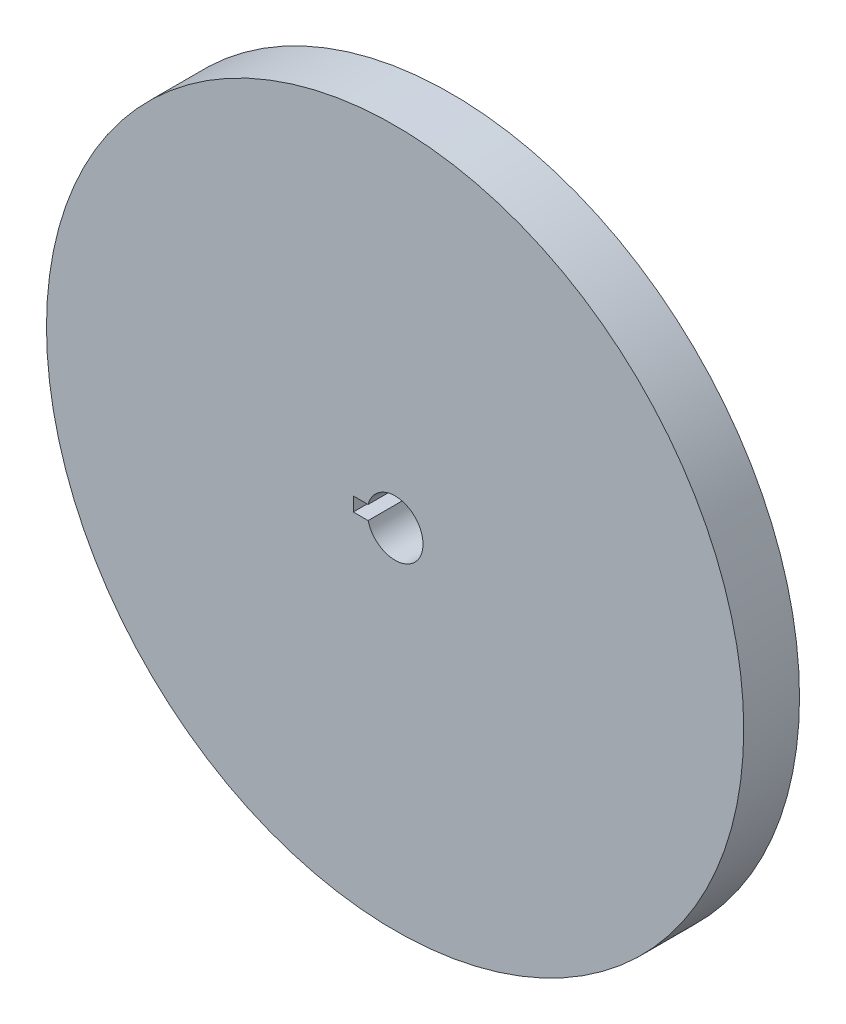
ISO-10303-21;
HEADER;
FILE_DESCRIPTION(('STEP AP214'),'2;1');
FILE_NAME('part.step','',(''),(''),'','','');
FILE_SCHEMA(('AUTOMOTIVE_DESIGN { 1 0 10303 214 1 1 1 1 }'));
ENDSEC;
DATA;
#1=APPLICATION_CONTEXT('core data for automotive mechanical design processes');
#2=APPLICATION_PROTOCOL_DEFINITION('international standard','automotive_design',2000,#1);
#3=PRODUCT_CONTEXT('',#1,'mechanical');
#4=PRODUCT('Part','Part','',(#3));
#5=PRODUCT_RELATED_PRODUCT_CATEGORY('part','',(#4));
#6=PRODUCT_DEFINITION_FORMATION('','',#4);
#7=PRODUCT_DEFINITION_CONTEXT('part definition',#1,'design');
#8=PRODUCT_DEFINITION('design','',#6,#7);
#9=PRODUCT_DEFINITION_SHAPE('','',#8);
#10=(LENGTH_UNIT() NAMED_UNIT(*) SI_UNIT(.MILLI.,.METRE.));
#11=(NAMED_UNIT(*) PLANE_ANGLE_UNIT() SI_UNIT($,.RADIAN.));
#12=(NAMED_UNIT(*) SI_UNIT($,.STERADIAN.) SOLID_ANGLE_UNIT());
#13=UNCERTAINTY_MEASURE_WITH_UNIT(LENGTH_MEASURE(1.E-05),#10,'distance_accuracy_value','');
#14=(GEOMETRIC_REPRESENTATION_CONTEXT(3) GLOBAL_UNCERTAINTY_ASSIGNED_CONTEXT((#13)) GLOBAL_UNIT_ASSIGNED_CONTEXT((#10,
#11,#12)) REPRESENTATION_CONTEXT('',''));
#15=CARTESIAN_POINT('',(0.,0.,0.));
#16=DIRECTION('',(0.,0.,1.));
#17=DIRECTION('',(1.,0.,0.));
#18=AXIS2_PLACEMENT_3D('',#15,#16,#17);
#19=CARTESIAN_POINT('',(0.,0.,20.));
#20=DIRECTION('',(0.,0.,-1.));
#21=DIRECTION('',(-1.,0.,0.));
#22=AXIS2_PLACEMENT_3D('',#19,#20,#21);
#23=CYLINDRICAL_SURFACE('',#22,125.);
#24=CARTESIAN_POINT('',(0.,0.,20.));
#25=DIRECTION('',(0.,0.,1.));
#26=DIRECTION('',(1.,0.,0.));
#27=AXIS2_PLACEMENT_3D('',#24,#25,#26);
#28=CIRCLE('',#27,125.);
#29=CARTESIAN_POINT('',(125.,0.,20.));
#30=VERTEX_POINT('',#29);
#31=EDGE_CURVE('E11',#30,#30,#28,.T.);
#32=ORIENTED_EDGE('',*,*,#31,.F.);
#33=EDGE_LOOP('',(#32));
#34=FACE_BOUND('',#33,.T.);
#35=CARTESIAN_POINT('',(0.,0.,0.));
#36=DIRECTION('',(0.,0.,1.));
#37=DIRECTION('',(1.,0.,0.));
#38=AXIS2_PLACEMENT_3D('',#35,#36,#37);
#39=CIRCLE('',#38,125.);
#40=CARTESIAN_POINT('',(125.,0.,0.));
#41=VERTEX_POINT('',#40);
#42=EDGE_CURVE('E36',#41,#41,#39,.T.);
#43=ORIENTED_EDGE('',*,*,#42,.T.);
#44=EDGE_LOOP('',(#43));
#45=FACE_BOUND('',#44,.T.);
#46=ADVANCED_FACE('F33',(#34,#45),#23,.T.);
#47=CARTESIAN_POINT('',(0.,0.,20.));
#48=DIRECTION('',(0.,0.,1.));
#49=DIRECTION('',(1.,0.,0.));
#50=AXIS2_PLACEMENT_3D('',#47,#48,#49);
#51=PLANE('',#50);
#52=CARTESIAN_POINT('',(0.,0.,20.));
#53=DIRECTION('',(0.,0.,1.));
#54=DIRECTION('',(1.,0.,0.));
#55=AXIS2_PLACEMENT_3D('',#52,#53,#54);
#56=CIRCLE('',#55,10.);
#57=CARTESIAN_POINT('',(-9.68245836551854,-2.5,20.));
#58=VERTEX_POINT('',#57);
#59=CARTESIAN_POINT('',(-9.68245836551854,2.5,20.));
#60=VERTEX_POINT('',#59);
#61=EDGE_CURVE('E47',#58,#60,#56,.T.);
#62=ORIENTED_EDGE('',*,*,#61,.F.);
#63=DIRECTION('',(1.,0.,0.));
#64=VECTOR('',#63,1.);
#65=CARTESIAN_POINT('',(-9.68245836551854,-2.5,20.));
#66=LINE('',#65,#64);
#67=CARTESIAN_POINT('',(-15.,-2.5,20.));
#68=VERTEX_POINT('',#67);
#69=EDGE_CURVE('E91',#68,#58,#66,.T.);
#70=ORIENTED_EDGE('',*,*,#69,.F.);
#71=DIRECTION('',(0.,-1.,0.));
#72=VECTOR('',#71,1.);
#73=CARTESIAN_POINT('',(-15.,2.5,20.));
#74=LINE('',#73,#72);
#75=CARTESIAN_POINT('',(-15.,2.5,20.));
#76=VERTEX_POINT('',#75);
#77=EDGE_CURVE('E94',#76,#68,#74,.T.);
#78=ORIENTED_EDGE('',*,*,#77,.F.);
#79=DIRECTION('',(-1.,0.,0.));
#80=VECTOR('',#79,1.);
#81=CARTESIAN_POINT('',(-9.68245836551854,2.5,20.));
#82=LINE('',#81,#80);
#83=EDGE_CURVE('E100',#60,#76,#82,.T.);
#84=ORIENTED_EDGE('',*,*,#83,.F.);
#85=EDGE_LOOP('',(#62,#70,#78,#84));
#86=FACE_BOUND('',#85,.T.);
#87=ORIENTED_EDGE('',*,*,#31,.T.);
#88=EDGE_LOOP('',(#87));
#89=FACE_BOUND('',#88,.T.);
#90=ADVANCED_FACE('F112',(#86,#89),#51,.T.);
#91=CARTESIAN_POINT('',(0.,0.,0.));
#92=DIRECTION('',(0.,0.,1.));
#93=DIRECTION('',(1.,0.,0.));
#94=AXIS2_PLACEMENT_3D('',#91,#92,#93);
#95=PLANE('',#94);
#96=DIRECTION('',(1.,0.,0.));
#97=VECTOR('',#96,1.);
#98=CARTESIAN_POINT('',(-9.68245836551854,-2.5,0.));
#99=LINE('',#98,#97);
#100=CARTESIAN_POINT('',(-15.,-2.5,0.));
#101=VERTEX_POINT('',#100);
#102=CARTESIAN_POINT('',(-9.68245836551854,-2.5,0.));
#103=VERTEX_POINT('',#102);
#104=EDGE_CURVE('E81',#101,#103,#99,.T.);
#105=ORIENTED_EDGE('',*,*,#104,.T.);
#106=CARTESIAN_POINT('',(0.,0.,0.));
#107=DIRECTION('',(0.,0.,1.));
#108=DIRECTION('',(1.,0.,0.));
#109=AXIS2_PLACEMENT_3D('',#106,#107,#108);
#110=CIRCLE('',#109,10.);
#111=CARTESIAN_POINT('',(-9.68245836551854,2.5,0.));
#112=VERTEX_POINT('',#111);
#113=EDGE_CURVE('E75',#103,#112,#110,.T.);
#114=ORIENTED_EDGE('',*,*,#113,.T.);
#115=DIRECTION('',(-1.,0.,0.));
#116=VECTOR('',#115,1.);
#117=CARTESIAN_POINT('',(-9.68245836551854,2.5,0.));
#118=LINE('',#117,#116);
#119=CARTESIAN_POINT('',(-15.,2.5,0.));
#120=VERTEX_POINT('',#119);
#121=EDGE_CURVE('E84',#112,#120,#118,.T.);
#122=ORIENTED_EDGE('',*,*,#121,.T.);
#123=DIRECTION('',(0.,-1.,0.));
#124=VECTOR('',#123,1.);
#125=CARTESIAN_POINT('',(-15.,2.5,0.));
#126=LINE('',#125,#124);
#127=EDGE_CURVE('E55',#120,#101,#126,.T.);
#128=ORIENTED_EDGE('',*,*,#127,.T.);
#129=EDGE_LOOP('',(#105,#114,#122,#128));
#130=FACE_BOUND('',#129,.T.);
#131=ORIENTED_EDGE('',*,*,#42,.F.);
#132=EDGE_LOOP('',(#131));
#133=FACE_BOUND('',#132,.T.);
#134=ADVANCED_FACE('F88',(#130,#133),#95,.F.);
#135=CARTESIAN_POINT('',(0.,0.,0.));
#136=DIRECTION('',(0.,0.,1.));
#137=DIRECTION('',(1.,0.,0.));
#138=AXIS2_PLACEMENT_3D('',#135,#136,#137);
#139=CYLINDRICAL_SURFACE('',#138,10.);
#140=ORIENTED_EDGE('',*,*,#61,.T.);
#141=DIRECTION('',(0.,0.,1.));
#142=VECTOR('',#141,1.);
#143=CARTESIAN_POINT('',(-9.68245836551854,2.5,0.));
#144=LINE('',#143,#142);
#145=EDGE_CURVE('E71',#112,#60,#144,.T.);
#146=ORIENTED_EDGE('',*,*,#145,.F.);
#147=ORIENTED_EDGE('',*,*,#113,.F.);
#148=DIRECTION('',(0.,0.,1.));
#149=VECTOR('',#148,1.);
#150=CARTESIAN_POINT('',(-9.68245836551854,-2.5,0.));
#151=LINE('',#150,#149);
#152=EDGE_CURVE('E104',#103,#58,#151,.T.);
#153=ORIENTED_EDGE('',*,*,#152,.T.);
#154=EDGE_LOOP('',(#140,#146,#147,#153));
#155=FACE_BOUND('',#154,.T.);
#156=ADVANCED_FACE('F73',(#155),#139,.F.);
#157=CARTESIAN_POINT('',(-9.68245836551854,-2.5,0.));
#158=DIRECTION('',(0.,-1.,0.));
#159=DIRECTION('',(1.,0.,0.));
#160=AXIS2_PLACEMENT_3D('',#157,#158,#159);
#161=PLANE('',#160);
#162=ORIENTED_EDGE('',*,*,#69,.T.);
#163=ORIENTED_EDGE('',*,*,#152,.F.);
#164=ORIENTED_EDGE('',*,*,#104,.F.);
#165=DIRECTION('',(0.,0.,1.));
#166=VECTOR('',#165,1.);
#167=CARTESIAN_POINT('',(-15.,-2.5,0.));
#168=LINE('',#167,#166);
#169=EDGE_CURVE('E106',#101,#68,#168,.T.);
#170=ORIENTED_EDGE('',*,*,#169,.T.);
#171=EDGE_LOOP('',(#162,#163,#164,#170));
#172=FACE_BOUND('',#171,.T.);
#173=ADVANCED_FACE('F115',(#172),#161,.F.);
#174=CARTESIAN_POINT('',(-15.,2.5,0.));
#175=DIRECTION('',(-1.,0.,0.));
#176=DIRECTION('',(0.,-1.,0.));
#177=AXIS2_PLACEMENT_3D('',#174,#175,#176);
#178=PLANE('',#177);
#179=ORIENTED_EDGE('',*,*,#77,.T.);
#180=ORIENTED_EDGE('',*,*,#169,.F.);
#181=ORIENTED_EDGE('',*,*,#127,.F.);
#182=DIRECTION('',(0.,0.,1.));
#183=VECTOR('',#182,1.);
#184=CARTESIAN_POINT('',(-15.,2.5,0.));
#185=LINE('',#184,#183);
#186=EDGE_CURVE('E80',#120,#76,#185,.T.);
#187=ORIENTED_EDGE('',*,*,#186,.T.);
#188=EDGE_LOOP('',(#179,#180,#181,#187));
#189=FACE_BOUND('',#188,.T.);
#190=ADVANCED_FACE('F108',(#189),#178,.F.);
#191=CARTESIAN_POINT('',(-9.68245836551854,2.5,0.));
#192=DIRECTION('',(0.,1.,0.));
#193=DIRECTION('',(-1.,0.,0.));
#194=AXIS2_PLACEMENT_3D('',#191,#192,#193);
#195=PLANE('',#194);
#196=ORIENTED_EDGE('',*,*,#83,.T.);
#197=ORIENTED_EDGE('',*,*,#186,.F.);
#198=ORIENTED_EDGE('',*,*,#121,.F.);
#199=ORIENTED_EDGE('',*,*,#145,.T.);
#200=EDGE_LOOP('',(#196,#197,#198,#199));
#201=FACE_BOUND('',#200,.T.);
#202=ADVANCED_FACE('F85',(#201),#195,.F.);
#203=CLOSED_SHELL('',(#46,#90,#134,#156,#173,#190,#202));
#204=MANIFOLD_SOLID_BREP('B2',#203);
#205=ADVANCED_BREP_SHAPE_REPRESENTATION('',(#18,#204),#14);
#206=SHAPE_DEFINITION_REPRESENTATION(#9,#205);
ENDSEC;
END-ISO-10303-21;
